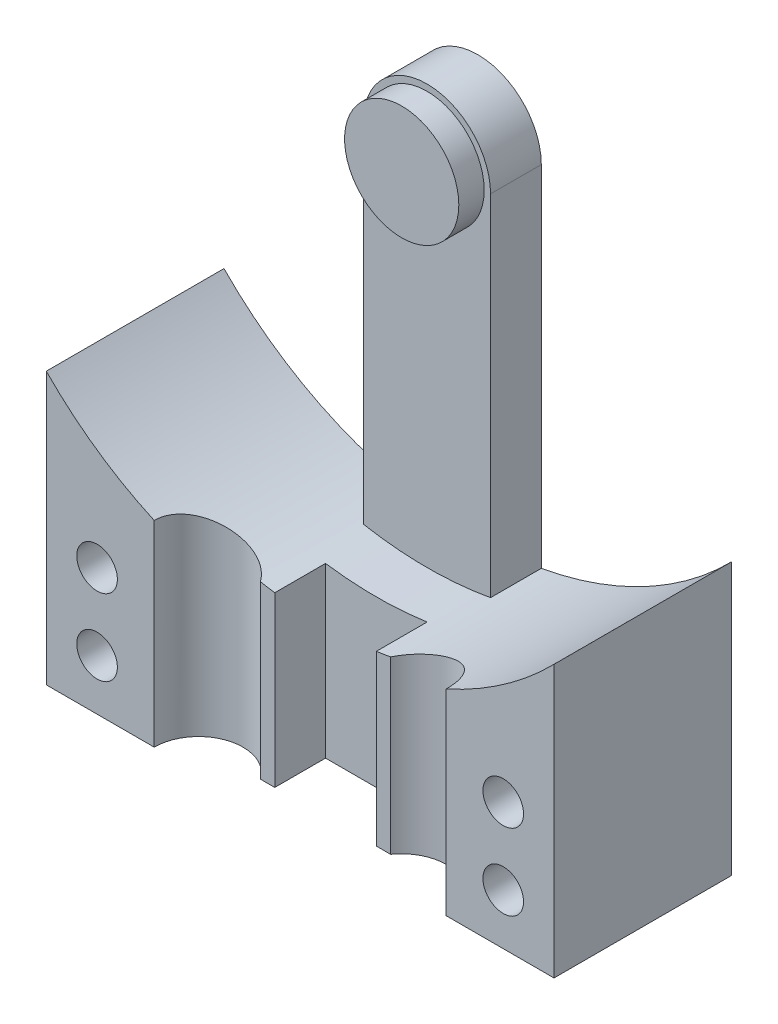
ISO-10303-21;
HEADER;
FILE_DESCRIPTION(('STEP AP214'),'2;1');
FILE_NAME('part.step','',(''),(''),'','','');
FILE_SCHEMA(('AUTOMOTIVE_DESIGN { 1 0 10303 214 1 1 1 1 }'));
ENDSEC;
DATA;
#1=APPLICATION_CONTEXT('core data for automotive mechanical design processes');
#2=APPLICATION_PROTOCOL_DEFINITION('international standard','automotive_design',2000,#1);
#3=PRODUCT_CONTEXT('',#1,'mechanical');
#4=PRODUCT('Part','Part','',(#3));
#5=PRODUCT_RELATED_PRODUCT_CATEGORY('part','',(#4));
#6=PRODUCT_DEFINITION_FORMATION('','',#4);
#7=PRODUCT_DEFINITION_CONTEXT('part definition',#1,'design');
#8=PRODUCT_DEFINITION('design','',#6,#7);
#9=PRODUCT_DEFINITION_SHAPE('','',#8);
#10=(LENGTH_UNIT() NAMED_UNIT(*) SI_UNIT(.MILLI.,.METRE.));
#11=(NAMED_UNIT(*) PLANE_ANGLE_UNIT() SI_UNIT($,.RADIAN.));
#12=(NAMED_UNIT(*) SI_UNIT($,.STERADIAN.) SOLID_ANGLE_UNIT());
#13=UNCERTAINTY_MEASURE_WITH_UNIT(LENGTH_MEASURE(1.E-05),#10,'distance_accuracy_value','');
#14=(GEOMETRIC_REPRESENTATION_CONTEXT(3) GLOBAL_UNCERTAINTY_ASSIGNED_CONTEXT((#13)) GLOBAL_UNIT_ASSIGNED_CONTEXT((#10,
#11,#12)) REPRESENTATION_CONTEXT('',''));
#15=CARTESIAN_POINT('',(0.,0.,0.));
#16=DIRECTION('',(0.,0.,1.));
#17=DIRECTION('',(1.,0.,0.));
#18=AXIS2_PLACEMENT_3D('',#15,#16,#17);
#19=CARTESIAN_POINT('',(0.,0.,7.));
#20=DIRECTION('',(0.,0.,-1.));
#21=DIRECTION('',(-1.,0.,0.));
#22=AXIS2_PLACEMENT_3D('',#19,#20,#21);
#23=CYLINDRICAL_SURFACE('',#22,14.);
#24=CARTESIAN_POINT('',(-5.75,-12.7646974112197,7.));
#25=CARTESIAN_POINT('',(-5.75000189053834,-12.7646949820717,6.9536056748903));
#26=CARTESIAN_POINT('',(-5.74815377005289,-12.7655292243542,6.90723516590935));
#27=CARTESIAN_POINT('',(-5.74079558024461,-12.7688406099331,6.81485759978246));
#28=CARTESIAN_POINT('',(-5.7352865458699,-12.7713172889088,6.7688504436344));
#29=CARTESIAN_POINT('',(-5.71338711484229,-12.7811375673264,6.63220455371071));
#30=CARTESIAN_POINT('',(-5.69162361873238,-12.7908719719431,6.54253357667148));
#31=CARTESIAN_POINT('',(-5.63467743792717,-12.8160588162994,6.36855813414669));
#32=CARTESIAN_POINT('',(-5.59950333289754,-12.8315075999794,6.28425027766922));
#33=CARTESIAN_POINT('',(-5.51701505107177,-12.8671892348959,6.12285513545865));
#34=CARTESIAN_POINT('',(-5.46969294902249,-12.8874252085769,6.04577260845731));
#35=CARTESIAN_POINT('',(-5.36214437777564,-12.9325535921242,5.8973578406083));
#36=CARTESIAN_POINT('',(-5.30145150011008,-12.957608488648,5.82641401516432));
#37=CARTESIAN_POINT('',(-5.17023092176259,-13.0105232743357,5.69552504735197));
#38=CARTESIAN_POINT('',(-5.09969993044948,-13.038384101151,5.63558360063578));
#39=CARTESIAN_POINT('',(-4.9446451138581,-13.0980114080074,5.52351767698197));
#40=CARTESIAN_POINT('',(-4.85945628332782,-13.1299125975737,5.47238335385173));
#41=CARTESIAN_POINT('',(-4.68184765418697,-13.1942876594728,5.38526367829712));
#42=CARTESIAN_POINT('',(-4.58942610297713,-13.2267616691227,5.34928201115647));
#43=CARTESIAN_POINT('',(-4.39554000433273,-13.2924841976696,5.29216778983188));
#44=CARTESIAN_POINT('',(-4.29385749778009,-13.3257059802071,5.27174024038447));
#45=CARTESIAN_POINT('',(-4.08790026378464,-13.390321734004,5.24914190993183));
#46=CARTESIAN_POINT('',(-3.98362553155516,-13.4217157018879,5.2469711626411));
#47=CARTESIAN_POINT('',(-3.77657635051463,-13.4814303576723,5.26125307452007));
#48=CARTESIAN_POINT('',(-3.67379727711227,-13.50977842985,5.27752130389903));
#49=CARTESIAN_POINT('',(-3.47193255052762,-13.5630593459072,5.32833337268214));
#50=CARTESIAN_POINT('',(-3.3728460244562,-13.5879930007036,5.36287286319037));
#51=CARTESIAN_POINT('',(-3.1854493492229,-13.6331159981332,5.44784754245569));
#52=CARTESIAN_POINT('',(-3.09686959802468,-13.6534524760392,5.49761005729263));
#53=CARTESIAN_POINT('',(-2.92915643393626,-13.6904135686977,5.61216040568269));
#54=CARTESIAN_POINT('',(-2.85002078486024,-13.707039062956,5.67694467163314));
#55=CARTESIAN_POINT('',(-2.70646206850301,-13.7360931174005,5.8172148815147));
#56=CARTESIAN_POINT('',(-2.64162172104466,-13.7486479663594,5.89224809907786));
#57=CARTESIAN_POINT('',(-2.5253497269985,-13.770480036917,6.05252704161274));
#58=CARTESIAN_POINT('',(-2.473920280943,-13.7797567207055,6.1377744392366));
#59=CARTESIAN_POINT('',(-2.38693010395009,-13.795089314298,6.31440699084264));
#60=CARTESIAN_POINT('',(-2.35110964192862,-13.8011982894606,6.40566006420865));
#61=CARTESIAN_POINT('',(-2.29520788542424,-13.8106059507261,6.59293395502945));
#62=CARTESIAN_POINT('',(-2.27510476736471,-13.8139085340679,6.68894796408377));
#63=CARTESIAN_POINT('',(-2.25876544163494,-13.8165838628274,6.82141601003498));
#64=CARTESIAN_POINT('',(-2.25547696824864,-13.8171208249112,6.85708451534379));
#65=CARTESIAN_POINT('',(-2.25109711371247,-13.8178351197109,6.92849680231269));
#66=CARTESIAN_POINT('',(-2.2500018764005,-13.8180130836237,6.96424034104868));
#67=CARTESIAN_POINT('',(-2.25,-13.8180136054355,7.));
#68=B_SPLINE_CURVE_WITH_KNOTS('',3,(#24,#25,#26,#27,#28,#29,#30,#31,#32,#33,#34,#35,#36,#37,#38,
#39,#40,#41,#42,#43,#44,#45,#46,#47,#48,#49,#50,#51,#52,#53,#54,#55,#56,#57,#58,#59,#60,#61,#62,
#63,#64,#65,#66,#67),.UNSPECIFIED.,.F.,.F.,(4,2,2,2,2,2,2,2,2,2,2,2,2,2,2,2,2,2,2,2,2,4),(0.,
0.139092219292273,0.278145133637704,0.555043965310998,0.831765942693738,1.10866891205412,
1.39744798784137,1.68632388649026,1.99799622017354,2.309744312097,2.63489692526134,
2.96005013887885,3.28197959635491,3.6038324631581,3.91312948221364,4.22235311963093,
4.5207781512994,4.81925211937181,5.11254988888105,5.40543968676446,5.51285828416295,
5.62008785106949),.UNSPECIFIED.);
#69=CARTESIAN_POINT('',(-5.75,-12.7646974112197,7.));
#70=VERTEX_POINT('',#69);
#71=CARTESIAN_POINT('',(-2.56385933836549,-13.7632345505363,6.));
#72=VERTEX_POINT('',#71);
#73=EDGE_CURVE('E218',#70,#72,#68,.T.);
#74=ORIENTED_EDGE('',*,*,#73,.T.);
#75=CARTESIAN_POINT('',(0.,0.,6.));
#76=DIRECTION('',(0.,0.,1.));
#77=DIRECTION('',(1.,0.,0.));
#78=AXIS2_PLACEMENT_3D('',#75,#76,#77);
#79=CIRCLE('',#78,14.);
#80=CARTESIAN_POINT('',(-2.,-13.856406460551,6.));
#81=VERTEX_POINT('',#80);
#82=EDGE_CURVE('E183',#72,#81,#79,.T.);
#83=ORIENTED_EDGE('',*,*,#82,.T.);
#84=DIRECTION('',(0.,0.,-1.));
#85=VECTOR('',#84,1.);
#86=CARTESIAN_POINT('',(-2.,-13.856406460551,7.));
#87=LINE('',#86,#85);
#88=CARTESIAN_POINT('',(-2.,-13.856406460551,4.));
#89=VERTEX_POINT('',#88);
#90=EDGE_CURVE('E157',#81,#89,#87,.T.);
#91=ORIENTED_EDGE('',*,*,#90,.T.);
#92=CARTESIAN_POINT('',(0.,0.,4.));
#93=DIRECTION('',(0.,0.,1.));
#94=DIRECTION('',(1.,0.,0.));
#95=AXIS2_PLACEMENT_3D('',#92,#93,#94);
#96=CIRCLE('',#95,14.);
#97=CARTESIAN_POINT('',(2.,-13.856406460551,4.));
#98=VERTEX_POINT('',#97);
#99=EDGE_CURVE('E185',#89,#98,#96,.T.);
#100=ORIENTED_EDGE('',*,*,#99,.T.);
#101=DIRECTION('',(0.,0.,-1.));
#102=VECTOR('',#101,1.);
#103=CARTESIAN_POINT('',(2.,-13.856406460551,7.));
#104=LINE('',#103,#102);
#105=CARTESIAN_POINT('',(2.,-13.856406460551,6.));
#106=VERTEX_POINT('',#105);
#107=EDGE_CURVE('E188',#98,#106,#104,.F.);
#108=ORIENTED_EDGE('',*,*,#107,.T.);
#109=CARTESIAN_POINT('',(0.,0.,6.));
#110=DIRECTION('',(0.,0.,1.));
#111=DIRECTION('',(1.,0.,0.));
#112=AXIS2_PLACEMENT_3D('',#109,#110,#111);
#113=CIRCLE('',#112,14.);
#114=CARTESIAN_POINT('',(2.56385933836549,-13.7632345505363,6.));
#115=VERTEX_POINT('',#114);
#116=EDGE_CURVE('E160',#106,#115,#113,.T.);
#117=ORIENTED_EDGE('',*,*,#116,.T.);
#118=CARTESIAN_POINT('',(4.,-13.4164078649987,5.25));
#119=CARTESIAN_POINT('',(4.10350168279073,-13.3855476695857,5.25000428651404));
#120=CARTESIAN_POINT('',(4.2067227616189,-13.3534566138628,5.25920879120629));
#121=CARTESIAN_POINT('',(4.40961479084573,-13.2878407889204,5.29548598351709));
#122=CARTESIAN_POINT('',(4.5092800919959,-13.2543139095619,5.32258587677814));
#123=CARTESIAN_POINT('',(4.70218684621989,-13.1871095933287,5.39376556168674));
#124=CARTESIAN_POINT('',(4.79543440367332,-13.1534323329003,5.43782894747883));
#125=CARTESIAN_POINT('',(4.97306914567581,-13.0873058122828,5.54184074011322));
#126=CARTESIAN_POINT('',(5.05745835053833,-13.0548562731734,5.60178551386893));
#127=CARTESIAN_POINT('',(5.21504718942886,-12.9927084875001,5.73631317655039));
#128=CARTESIAN_POINT('',(5.28823328796249,-12.9630135858593,5.81091352770343));
#129=CARTESIAN_POINT('',(5.42079965961544,-12.9081404920993,5.97297715760625));
#130=CARTESIAN_POINT('',(5.48018367350823,-12.8829610765735,6.06043694055322));
#131=CARTESIAN_POINT('',(5.57991468511833,-12.8400681373101,6.24078954258436));
#132=CARTESIAN_POINT('',(5.62112442686657,-12.8220219059157,6.33312456097229));
#133=CARTESIAN_POINT('',(5.68719135614027,-12.792856469617,6.52448903141355));
#134=CARTESIAN_POINT('',(5.71205974228838,-12.7817325211955,6.62351384756442));
#135=CARTESIAN_POINT('',(5.74287618976031,-12.7679141558519,6.81658668081193));
#136=CARTESIAN_POINT('',(5.75021831396984,-12.7645989484153,6.91036945532175));
#137=CARTESIAN_POINT('',(5.74977196526244,-12.7648002542795,7.09787970826666));
#138=CARTESIAN_POINT('',(5.74198743505961,-12.7683149873781,7.19160719474298));
#139=CARTESIAN_POINT('',(5.71227757032898,-12.7816324597895,7.37236719872148));
#140=CARTESIAN_POINT('',(5.69093965892574,-12.7911739012533,7.45951700579993));
#141=CARTESIAN_POINT('',(5.63553756745239,-12.8156789638197,7.6288529970594));
#142=CARTESIAN_POINT('',(5.60147188461279,-12.8306432251889,7.7110385937839));
#143=CARTESIAN_POINT('',(5.52047031807695,-12.8657067716975,7.87120214994966));
#144=CARTESIAN_POINT('',(5.47314067680288,-12.8859616127954,7.9489461529802));
#145=CARTESIAN_POINT('',(5.3676738531064,-12.9302491921815,8.09550311543989));
#146=CARTESIAN_POINT('',(5.30953321632972,-12.9542831375978,8.16431320831775));
#147=CARTESIAN_POINT('',(5.17915887551196,-13.0069834674489,8.29667417935614));
#148=CARTESIAN_POINT('',(5.10618396269485,-13.0358641895512,8.35940977762513));
#149=CARTESIAN_POINT('',(4.95145796710795,-13.0954166595084,8.47186373330557));
#150=CARTESIAN_POINT('',(4.86970379128208,-13.126089036841,8.52157748158354));
#151=CARTESIAN_POINT('',(4.69372799362968,-13.1900810195281,8.60983118401641));
#152=CARTESIAN_POINT('',(4.59903929129139,-13.2234414357176,8.64741336700592));
#153=CARTESIAN_POINT('',(4.40437776405604,-13.2895455956853,8.70566793441002));
#154=CARTESIAN_POINT('',(4.3044041660828,-13.3222892482876,8.72633783756342));
#155=CARTESIAN_POINT('',(4.10012043824881,-13.3865851014044,8.75020680270216));
#156=CARTESIAN_POINT('',(3.99576567229775,-13.4181080465271,8.75310654106982));
#157=CARTESIAN_POINT('',(3.78741255884286,-13.4783998424854,8.74017104920506));
#158=CARTESIAN_POINT('',(3.68341415918711,-13.5071691144901,8.72433868897674));
#159=CARTESIAN_POINT('',(3.48200801456737,-13.5604634672849,8.67470365515997));
#160=CARTESIAN_POINT('',(3.38449688952875,-13.5850862151212,8.64142654219612));
#161=CARTESIAN_POINT('',(3.19612845914592,-13.6306329564179,8.55785081415014));
#162=CARTESIAN_POINT('',(3.10526958145221,-13.6515578255862,8.50755623727979));
#163=CARTESIAN_POINT('',(2.93680510164311,-13.6887666876803,8.39357209126664));
#164=CARTESIAN_POINT('',(2.85881349430754,-13.7052034558243,8.33050244049394));
#165=CARTESIAN_POINT('',(2.71442380464817,-13.7345309820168,8.19156472638702));
#166=CARTESIAN_POINT('',(2.64802394211497,-13.7474222847375,8.1156986317995));
#167=CARTESIAN_POINT('',(2.53063840106815,-13.7695081075673,7.95554758628387));
#168=CARTESIAN_POINT('',(2.47928791677789,-13.7787922894433,7.87154211576135));
#169=CARTESIAN_POINT('',(2.39130974982023,-13.794333728174,7.69588923392478));
#170=CARTESIAN_POINT('',(2.35468106148032,-13.8005911917951,7.60424234512645));
#171=CARTESIAN_POINT('',(2.29762622665663,-13.8102044661532,7.41700917087699));
#172=CARTESIAN_POINT('',(2.27702509981617,-13.8135916505541,7.32147776685499));
#173=CARTESIAN_POINT('',(2.25199048147884,-13.8176952879699,7.1282634533353));
#174=CARTESIAN_POINT('',(2.24755665253957,-13.818411796727,7.03058058878552));
#175=CARTESIAN_POINT('',(2.25498171392298,-13.8172019700481,6.83614449602456));
#176=CARTESIAN_POINT('',(2.26679228812257,-13.8152834720007,6.73938936917804));
#177=CARTESIAN_POINT('',(2.30625818288144,-13.8087497129356,6.54926196404802));
#178=CARTESIAN_POINT('',(2.3339133592252,-13.8041344764632,6.45588965498276));
#179=CARTESIAN_POINT('',(2.40422445572187,-13.7920618201917,6.2751520769816));
#180=CARTESIAN_POINT('',(2.44688324656481,-13.7846038564614,6.18778796143985));
#181=CARTESIAN_POINT('',(2.54587721077315,-13.7666636830642,6.02153888773997));
#182=CARTESIAN_POINT('',(2.60221176704292,-13.7561816098511,5.94265354722321));
#183=CARTESIAN_POINT('',(2.72703288416464,-13.7319822323767,5.79525317746501));
#184=CARTESIAN_POINT('',(2.79556201945808,-13.7182535362046,5.72677609166025));
#185=CARTESIAN_POINT('',(2.94252715261543,-13.6874818607928,5.60231406202415));
#186=CARTESIAN_POINT('',(3.02096564763651,-13.6704380455574,5.54633227687974));
#187=CARTESIAN_POINT('',(3.18640217674972,-13.632832559336,5.44759528862041));
#188=CARTESIAN_POINT('',(3.27349705685734,-13.6122285886178,5.40501886060986));
#189=CARTESIAN_POINT('',(3.45273108954374,-13.5678717602734,5.33499566634189));
#190=CARTESIAN_POINT('',(3.54486541676023,-13.5441218849618,5.30753469620491));
#191=CARTESIAN_POINT('',(3.69791670532171,-13.5029351608654,5.27518692549052));
#192=CARTESIAN_POINT('',(3.75812803472161,-13.4863046122,5.26573210459441));
#193=CARTESIAN_POINT('',(3.87892485943255,-13.4520587956235,5.25313741832971));
#194=CARTESIAN_POINT('',(3.9395103512939,-13.4344435367791,5.24999749482596));
#195=CARTESIAN_POINT('',(4.,-13.4164078649987,5.25));
#196=B_SPLINE_CURVE_WITH_KNOTS('',3,(#118,#119,#120,#121,#122,#123,#124,#125,#126,#127,#128,
#129,#130,#131,#132,#133,#134,#135,#136,#137,#138,#139,#140,#141,#142,#143,#144,#145,#146,#147,
#148,#149,#150,#151,#152,#153,#154,#155,#156,#157,#158,#159,#160,#161,#162,#163,#164,#165,#166,
#167,#168,#169,#170,#171,#172,#173,#174,#175,#176,#177,#178,#179,#180,#181,#182,#183,#184,#185,
#186,#187,#188,#189,#190,#191,#192,#193,#194,#195),.UNSPECIFIED.,.T.,.F.,(4,2,2,2,2,2,2,2,2,2,2,
2,2,2,2,2,2,2,2,2,2,2,2,2,2,2,2,2,2,2,2,2,2,2,2,2,2,2,4),(0.,0.323778564799145,0.64805049389955,
0.972009595450396,1.29589465078389,1.62016798405182,1.94435332689327,2.25082894941158,
2.55709432657649,2.83804326063293,3.11891897607034,3.38838211103835,3.65787707161011,
3.93642139933994,4.21505488161231,4.51518432935328,4.81541986594336,5.13553435098462,
5.45569579275217,5.78123558741588,6.10672551155568,6.42292954165267,6.73905858969807,
7.04247632000506,7.34584741167497,7.64110359247917,7.93633960036964,8.22830529553565,
8.52026489678485,8.81135799083462,9.102448435435,9.39359460563655,9.68472764080387,
9.97689778512919,10.2691417037041,10.5651323803045,10.8608444398267,11.0500725897479,
11.2392989976206),.UNSPECIFIED.);
#197=CARTESIAN_POINT('',(5.75,-12.7646974112197,7.));
#198=VERTEX_POINT('',#197);
#199=EDGE_CURVE('E195',#115,#198,#196,.T.);
#200=ORIENTED_EDGE('',*,*,#199,.T.);
#201=CARTESIAN_POINT('',(0.,0.,7.));
#202=DIRECTION('',(0.,0.,1.));
#203=DIRECTION('',(1.,0.,0.));
#204=AXIS2_PLACEMENT_3D('',#201,#202,#203);
#205=CIRCLE('',#204,14.);
#206=CARTESIAN_POINT('',(10.,-9.79795897113271,7.));
#207=VERTEX_POINT('',#206);
#208=EDGE_CURVE('E291',#198,#207,#205,.T.);
#209=ORIENTED_EDGE('',*,*,#208,.T.);
#210=DIRECTION('',(0.,0.,-1.));
#211=VECTOR('',#210,1.);
#212=CARTESIAN_POINT('',(10.,-9.79795897113271,7.));
#213=LINE('',#212,#211);
#214=CARTESIAN_POINT('',(10.,-9.79795897113271,0.));
#215=VERTEX_POINT('',#214);
#216=EDGE_CURVE('E301',#207,#215,#213,.T.);
#217=ORIENTED_EDGE('',*,*,#216,.T.);
#218=CARTESIAN_POINT('',(0.,0.,0.));
#219=DIRECTION('',(0.,0.,1.));
#220=DIRECTION('',(1.,0.,0.));
#221=AXIS2_PLACEMENT_3D('',#218,#219,#220);
#222=CIRCLE('',#221,14.);
#223=CARTESIAN_POINT('',(2.5,-13.7749773139559,0.));
#224=VERTEX_POINT('',#223);
#225=EDGE_CURVE('E286',#224,#215,#222,.T.);
#226=ORIENTED_EDGE('',*,*,#225,.F.);
#227=DIRECTION('',(0.,0.,-1.));
#228=VECTOR('',#227,1.);
#229=CARTESIAN_POINT('',(2.5,-13.7749773139559,7.));
#230=LINE('',#229,#228);
#231=CARTESIAN_POINT('',(2.5,-13.7749773139559,2.));
#232=VERTEX_POINT('',#231);
#233=EDGE_CURVE('E278',#224,#232,#230,.F.);
#234=ORIENTED_EDGE('',*,*,#233,.T.);
#235=CARTESIAN_POINT('',(0.,0.,2.));
#236=DIRECTION('',(0.,0.,1.));
#237=DIRECTION('',(1.,0.,0.));
#238=AXIS2_PLACEMENT_3D('',#235,#236,#237);
#239=CIRCLE('',#238,14.);
#240=CARTESIAN_POINT('',(-2.5,-13.7749773139559,2.));
#241=VERTEX_POINT('',#240);
#242=EDGE_CURVE('E284',#241,#232,#239,.T.);
#243=ORIENTED_EDGE('',*,*,#242,.F.);
#244=DIRECTION('',(0.,0.,-1.));
#245=VECTOR('',#244,1.);
#246=CARTESIAN_POINT('',(-2.5,-13.7749773139559,7.));
#247=LINE('',#246,#245);
#248=CARTESIAN_POINT('',(-2.5,-13.7749773139559,0.));
#249=VERTEX_POINT('',#248);
#250=EDGE_CURVE('E281',#241,#249,#247,.T.);
#251=ORIENTED_EDGE('',*,*,#250,.T.);
#252=CARTESIAN_POINT('',(-10.,-9.79795897113271,0.));
#253=VERTEX_POINT('',#252);
#254=EDGE_CURVE('E302',#253,#249,#222,.T.);
#255=ORIENTED_EDGE('',*,*,#254,.F.);
#256=DIRECTION('',(0.,0.,-1.));
#257=VECTOR('',#256,1.);
#258=CARTESIAN_POINT('',(-10.,-9.79795897113271,7.));
#259=LINE('',#258,#257);
#260=CARTESIAN_POINT('',(-10.,-9.79795897113271,7.));
#261=VERTEX_POINT('',#260);
#262=EDGE_CURVE('E320',#261,#253,#259,.T.);
#263=ORIENTED_EDGE('',*,*,#262,.F.);
#264=EDGE_CURVE('E287',#261,#70,#205,.T.);
#265=ORIENTED_EDGE('',*,*,#264,.T.);
#266=EDGE_LOOP('',(#74,#83,#91,#100,#108,#117,#200,#209,#217,#226,#234,#243,#251,#255,#263,#265));
#267=FACE_BOUND('',#266,.T.);
#268=ADVANCED_FACE('F35',(#267),#23,.F.);
#269=CARTESIAN_POINT('',(0.,-20.5,7.));
#270=DIRECTION('',(0.,-1.,0.));
#271=DIRECTION('',(1.,0.,0.));
#272=AXIS2_PLACEMENT_3D('',#269,#270,#271);
#273=PLANE('',#272);
#274=DIRECTION('',(0.,0.,1.));
#275=VECTOR('',#274,1.);
#276=CARTESIAN_POINT('',(-2.,-20.5,6.));
#277=LINE('',#276,#275);
#278=CARTESIAN_POINT('',(-2.,-20.5,4.));
#279=VERTEX_POINT('',#278);
#280=CARTESIAN_POINT('',(-2.,-20.5,6.));
#281=VERTEX_POINT('',#280);
#282=EDGE_CURVE('E154',#279,#281,#277,.T.);
#283=ORIENTED_EDGE('',*,*,#282,.T.);
#284=DIRECTION('',(-1.,0.,0.));
#285=VECTOR('',#284,1.);
#286=CARTESIAN_POINT('',(-3.,-20.5,6.));
#287=LINE('',#286,#285);
#288=CARTESIAN_POINT('',(-2.56385933836549,-20.5,6.));
#289=VERTEX_POINT('',#288);
#290=EDGE_CURVE('E163',#281,#289,#287,.T.);
#291=ORIENTED_EDGE('',*,*,#290,.T.);
#292=CARTESIAN_POINT('',(-4.,-20.5,7.));
#293=DIRECTION('',(0.,1.,0.));
#294=DIRECTION('',(0.,0.,1.));
#295=AXIS2_PLACEMENT_3D('',#292,#293,#294);
#296=CIRCLE('',#295,1.75);
#297=CARTESIAN_POINT('',(-5.75,-20.5,7.));
#298=VERTEX_POINT('',#297);
#299=EDGE_CURVE('E58',#289,#298,#296,.T.);
#300=ORIENTED_EDGE('',*,*,#299,.T.);
#301=DIRECTION('',(-1.,0.,0.));
#302=VECTOR('',#301,1.);
#303=CARTESIAN_POINT('',(0.,-20.5,7.));
#304=LINE('',#303,#302);
#305=CARTESIAN_POINT('',(-10.,-20.5,7.));
#306=VERTEX_POINT('',#305);
#307=EDGE_CURVE('E294',#298,#306,#304,.T.);
#308=ORIENTED_EDGE('',*,*,#307,.T.);
#309=DIRECTION('',(0.,0.,-1.));
#310=VECTOR('',#309,1.);
#311=CARTESIAN_POINT('',(-10.,-20.5,7.));
#312=LINE('',#311,#310);
#313=CARTESIAN_POINT('',(-10.,-20.5,0.));
#314=VERTEX_POINT('',#313);
#315=EDGE_CURVE('E317',#306,#314,#312,.T.);
#316=ORIENTED_EDGE('',*,*,#315,.T.);
#317=DIRECTION('',(-1.,0.,0.));
#318=VECTOR('',#317,1.);
#319=CARTESIAN_POINT('',(0.,-20.5,0.));
#320=LINE('',#319,#318);
#321=CARTESIAN_POINT('',(10.,-20.5,0.));
#322=VERTEX_POINT('',#321);
#323=EDGE_CURVE('E308',#322,#314,#320,.T.);
#324=ORIENTED_EDGE('',*,*,#323,.F.);
#325=DIRECTION('',(0.,0.,-1.));
#326=VECTOR('',#325,1.);
#327=CARTESIAN_POINT('',(10.,-20.5,7.));
#328=LINE('',#327,#326);
#329=CARTESIAN_POINT('',(10.,-20.5,7.));
#330=VERTEX_POINT('',#329);
#331=EDGE_CURVE('E315',#330,#322,#328,.T.);
#332=ORIENTED_EDGE('',*,*,#331,.F.);
#333=CARTESIAN_POINT('',(5.75,-20.5,7.));
#334=VERTEX_POINT('',#333);
#335=EDGE_CURVE('E295',#330,#334,#304,.T.);
#336=ORIENTED_EDGE('',*,*,#335,.T.);
#337=CARTESIAN_POINT('',(4.,-20.5,7.));
#338=DIRECTION('',(0.,1.,0.));
#339=DIRECTION('',(0.,0.,1.));
#340=AXIS2_PLACEMENT_3D('',#337,#338,#339);
#341=CIRCLE('',#340,1.75);
#342=CARTESIAN_POINT('',(2.56385933836549,-20.5,6.));
#343=VERTEX_POINT('',#342);
#344=EDGE_CURVE('E192',#334,#343,#341,.T.);
#345=ORIENTED_EDGE('',*,*,#344,.T.);
#346=DIRECTION('',(-1.,0.,0.));
#347=VECTOR('',#346,1.);
#348=CARTESIAN_POINT('',(2.,-20.5,6.));
#349=LINE('',#348,#347);
#350=CARTESIAN_POINT('',(2.,-20.5,6.));
#351=VERTEX_POINT('',#350);
#352=EDGE_CURVE('E50',#343,#351,#349,.T.);
#353=ORIENTED_EDGE('',*,*,#352,.T.);
#354=DIRECTION('',(0.,0.,-1.));
#355=VECTOR('',#354,1.);
#356=CARTESIAN_POINT('',(2.,-20.5,4.));
#357=LINE('',#356,#355);
#358=CARTESIAN_POINT('',(2.,-20.5,4.));
#359=VERTEX_POINT('',#358);
#360=EDGE_CURVE('E173',#351,#359,#357,.T.);
#361=ORIENTED_EDGE('',*,*,#360,.T.);
#362=DIRECTION('',(-1.,0.,0.));
#363=VECTOR('',#362,1.);
#364=CARTESIAN_POINT('',(-2.,-20.5,4.));
#365=LINE('',#364,#363);
#366=EDGE_CURVE('E169',#359,#279,#365,.T.);
#367=ORIENTED_EDGE('',*,*,#366,.T.);
#368=EDGE_LOOP('',(#283,#291,#300,#308,#316,#324,#332,#336,#345,#353,#361,#367));
#369=FACE_BOUND('',#368,.T.);
#370=ADVANCED_FACE('F166',(#369),#273,.T.);
#371=CARTESIAN_POINT('',(-4.,-2.,7.));
#372=DIRECTION('',(0.,-1.,0.));
#373=DIRECTION('',(0.,0.,-1.));
#374=AXIS2_PLACEMENT_3D('',#371,#372,#373);
#375=CYLINDRICAL_SURFACE('',#374,1.75);
#376=ORIENTED_EDGE('',*,*,#299,.F.);
#377=DIRECTION('',(0.,-1.,0.));
#378=VECTOR('',#377,1.);
#379=CARTESIAN_POINT('',(-2.56385933836549,-2.,6.));
#380=LINE('',#379,#378);
#381=EDGE_CURVE('E11',#289,#72,#380,.F.);
#382=ORIENTED_EDGE('',*,*,#381,.T.);
#383=ORIENTED_EDGE('',*,*,#73,.F.);
#384=DIRECTION('',(0.,-1.,0.));
#385=VECTOR('',#384,1.);
#386=CARTESIAN_POINT('',(-5.75,-2.,7.));
#387=LINE('',#386,#385);
#388=EDGE_CURVE('E224',#298,#70,#387,.F.);
#389=ORIENTED_EDGE('',*,*,#388,.F.);
#390=EDGE_LOOP('',(#376,#382,#383,#389));
#391=FACE_BOUND('',#390,.T.);
#392=ADVANCED_FACE('F208',(#391),#375,.F.);
#393=CARTESIAN_POINT('',(4.,-2.,7.));
#394=DIRECTION('',(0.,-1.,0.));
#395=DIRECTION('',(0.,0.,-1.));
#396=AXIS2_PLACEMENT_3D('',#393,#394,#395);
#397=CYLINDRICAL_SURFACE('',#396,1.75);
#398=ORIENTED_EDGE('',*,*,#199,.F.);
#399=DIRECTION('',(0.,-1.,0.));
#400=VECTOR('',#399,1.);
#401=CARTESIAN_POINT('',(2.56385933836549,-2.,6.));
#402=LINE('',#401,#400);
#403=EDGE_CURVE('E43',#115,#343,#402,.T.);
#404=ORIENTED_EDGE('',*,*,#403,.T.);
#405=ORIENTED_EDGE('',*,*,#344,.F.);
#406=DIRECTION('',(0.,-1.,0.));
#407=VECTOR('',#406,1.);
#408=CARTESIAN_POINT('',(5.75,-2.,7.));
#409=LINE('',#408,#407);
#410=EDGE_CURVE('E200',#198,#334,#409,.T.);
#411=ORIENTED_EDGE('',*,*,#410,.F.);
#412=EDGE_LOOP('',(#398,#404,#405,#411));
#413=FACE_BOUND('',#412,.T.);
#414=ADVANCED_FACE('F202',(#413),#397,.F.);
#415=CARTESIAN_POINT('',(0.,0.,7.));
#416=DIRECTION('',(0.,0.,1.));
#417=DIRECTION('',(1.,0.,0.));
#418=AXIS2_PLACEMENT_3D('',#415,#416,#417);
#419=PLANE('',#418);
#420=CARTESIAN_POINT('',(8.,-15.5,7.));
#421=DIRECTION('',(0.,0.,1.));
#422=DIRECTION('',(1.,0.,0.));
#423=AXIS2_PLACEMENT_3D('',#420,#421,#422);
#424=CIRCLE('',#423,0.800000000000001);
#425=CARTESIAN_POINT('',(8.8,-15.5,7.));
#426=VERTEX_POINT('',#425);
#427=EDGE_CURVE('E234',#426,#426,#424,.T.);
#428=ORIENTED_EDGE('',*,*,#427,.F.);
#429=EDGE_LOOP('',(#428));
#430=FACE_BOUND('',#429,.T.);
#431=CARTESIAN_POINT('',(8.,-18.5,7.));
#432=DIRECTION('',(0.,0.,1.));
#433=DIRECTION('',(1.,0.,0.));
#434=AXIS2_PLACEMENT_3D('',#431,#432,#433);
#435=CIRCLE('',#434,0.8);
#436=CARTESIAN_POINT('',(8.8,-18.5,7.));
#437=VERTEX_POINT('',#436);
#438=EDGE_CURVE('E228',#437,#437,#435,.T.);
#439=ORIENTED_EDGE('',*,*,#438,.F.);
#440=EDGE_LOOP('',(#439));
#441=FACE_BOUND('',#440,.T.);
#442=ORIENTED_EDGE('',*,*,#208,.F.);
#443=ORIENTED_EDGE('',*,*,#410,.T.);
#444=ORIENTED_EDGE('',*,*,#335,.F.);
#445=DIRECTION('',(0.,-1.,0.));
#446=VECTOR('',#445,1.);
#447=CARTESIAN_POINT('',(10.,0.,7.));
#448=LINE('',#447,#446);
#449=EDGE_CURVE('E298',#207,#330,#448,.T.);
#450=ORIENTED_EDGE('',*,*,#449,.F.);
#451=EDGE_LOOP('',(#442,#443,#444,#450));
#452=FACE_BOUND('',#451,.T.);
#453=ADVANCED_FACE('F207',(#430,#441,#452),#419,.T.);
#454=CARTESIAN_POINT('',(-8.,-15.5,7.));
#455=DIRECTION('',(0.,0.,1.));
#456=DIRECTION('',(1.,0.,0.));
#457=AXIS2_PLACEMENT_3D('',#454,#455,#456);
#458=CIRCLE('',#457,0.800000000000001);
#459=CARTESIAN_POINT('',(-7.2,-15.5,7.));
#460=VERTEX_POINT('',#459);
#461=EDGE_CURVE('E240',#460,#460,#458,.T.);
#462=ORIENTED_EDGE('',*,*,#461,.F.);
#463=EDGE_LOOP('',(#462));
#464=FACE_BOUND('',#463,.T.);
#465=CARTESIAN_POINT('',(-8.,-18.5,7.));
#466=DIRECTION('',(0.,0.,1.));
#467=DIRECTION('',(1.,0.,0.));
#468=AXIS2_PLACEMENT_3D('',#465,#466,#467);
#469=CIRCLE('',#468,0.799999999999999);
#470=CARTESIAN_POINT('',(-7.2,-18.5,7.));
#471=VERTEX_POINT('',#470);
#472=EDGE_CURVE('E246',#471,#471,#469,.T.);
#473=ORIENTED_EDGE('',*,*,#472,.F.);
#474=EDGE_LOOP('',(#473));
#475=FACE_BOUND('',#474,.T.);
#476=ORIENTED_EDGE('',*,*,#307,.F.);
#477=ORIENTED_EDGE('',*,*,#388,.T.);
#478=ORIENTED_EDGE('',*,*,#264,.F.);
#479=DIRECTION('',(0.,1.,0.));
#480=VECTOR('',#479,1.);
#481=CARTESIAN_POINT('',(-10.,0.,7.));
#482=LINE('',#481,#480);
#483=EDGE_CURVE('E290',#306,#261,#482,.T.);
#484=ORIENTED_EDGE('',*,*,#483,.F.);
#485=EDGE_LOOP('',(#476,#477,#478,#484));
#486=FACE_BOUND('',#485,.T.);
#487=ADVANCED_FACE('F347',(#464,#475,#486),#419,.T.);
#488=CARTESIAN_POINT('',(0.,0.,0.));
#489=DIRECTION('',(0.,0.,1.));
#490=DIRECTION('',(1.,0.,0.));
#491=AXIS2_PLACEMENT_3D('',#488,#489,#490);
#492=PLANE('',#491);
#493=CARTESIAN_POINT('',(8.,-15.5,0.));
#494=DIRECTION('',(0.,0.,1.));
#495=DIRECTION('',(1.,0.,0.));
#496=AXIS2_PLACEMENT_3D('',#493,#494,#495);
#497=CIRCLE('',#496,0.800000000000001);
#498=CARTESIAN_POINT('',(8.8,-15.5,0.));
#499=VERTEX_POINT('',#498);
#500=EDGE_CURVE('E231',#499,#499,#497,.T.);
#501=ORIENTED_EDGE('',*,*,#500,.T.);
#502=EDGE_LOOP('',(#501));
#503=FACE_BOUND('',#502,.T.);
#504=CARTESIAN_POINT('',(-8.,-18.5,0.));
#505=DIRECTION('',(0.,0.,1.));
#506=DIRECTION('',(1.,0.,0.));
#507=AXIS2_PLACEMENT_3D('',#504,#505,#506);
#508=CIRCLE('',#507,0.799999999999999);
#509=CARTESIAN_POINT('',(-7.2,-18.5,0.));
#510=VERTEX_POINT('',#509);
#511=EDGE_CURVE('E243',#510,#510,#508,.T.);
#512=ORIENTED_EDGE('',*,*,#511,.T.);
#513=EDGE_LOOP('',(#512));
#514=FACE_BOUND('',#513,.T.);
#515=ORIENTED_EDGE('',*,*,#323,.T.);
#516=DIRECTION('',(0.,1.,0.));
#517=VECTOR('',#516,1.);
#518=CARTESIAN_POINT('',(-10.,0.,0.));
#519=LINE('',#518,#517);
#520=EDGE_CURVE('E305',#314,#253,#519,.T.);
#521=ORIENTED_EDGE('',*,*,#520,.T.);
#522=ORIENTED_EDGE('',*,*,#254,.T.);
#523=DIRECTION('',(0.,-1.,0.));
#524=VECTOR('',#523,1.);
#525=CARTESIAN_POINT('',(-2.5,0.,0.));
#526=LINE('',#525,#524);
#527=CARTESIAN_POINT('',(-2.5,0.,0.));
#528=VERTEX_POINT('',#527);
#529=EDGE_CURVE('E270',#528,#249,#526,.T.);
#530=ORIENTED_EDGE('',*,*,#529,.F.);
#531=CARTESIAN_POINT('',(0.,0.,0.));
#532=DIRECTION('',(0.,0.,1.));
#533=DIRECTION('',(1.,0.,0.));
#534=AXIS2_PLACEMENT_3D('',#531,#532,#533);
#535=CIRCLE('',#534,2.5);
#536=CARTESIAN_POINT('',(2.5,0.,0.));
#537=VERTEX_POINT('',#536);
#538=EDGE_CURVE('E255',#537,#528,#535,.T.);
#539=ORIENTED_EDGE('',*,*,#538,.F.);
#540=DIRECTION('',(0.,1.,0.));
#541=VECTOR('',#540,1.);
#542=CARTESIAN_POINT('',(2.5,-20.5,0.));
#543=LINE('',#542,#541);
#544=EDGE_CURVE('E262',#224,#537,#543,.T.);
#545=ORIENTED_EDGE('',*,*,#544,.F.);
#546=ORIENTED_EDGE('',*,*,#225,.T.);
#547=DIRECTION('',(0.,-1.,0.));
#548=VECTOR('',#547,1.);
#549=CARTESIAN_POINT('',(10.,0.,0.));
#550=LINE('',#549,#548);
#551=EDGE_CURVE('E310',#215,#322,#550,.T.);
#552=ORIENTED_EDGE('',*,*,#551,.T.);
#553=EDGE_LOOP('',(#515,#521,#522,#530,#539,#545,#546,#552));
#554=FACE_BOUND('',#553,.T.);
#555=CARTESIAN_POINT('',(-8.,-15.5,0.));
#556=DIRECTION('',(0.,0.,1.));
#557=DIRECTION('',(1.,0.,0.));
#558=AXIS2_PLACEMENT_3D('',#555,#556,#557);
#559=CIRCLE('',#558,0.800000000000001);
#560=CARTESIAN_POINT('',(-7.2,-15.5,0.));
#561=VERTEX_POINT('',#560);
#562=EDGE_CURVE('E237',#561,#561,#559,.T.);
#563=ORIENTED_EDGE('',*,*,#562,.T.);
#564=EDGE_LOOP('',(#563));
#565=FACE_BOUND('',#564,.T.);
#566=CARTESIAN_POINT('',(8.,-18.5,0.));
#567=DIRECTION('',(0.,0.,1.));
#568=DIRECTION('',(1.,0.,0.));
#569=AXIS2_PLACEMENT_3D('',#566,#567,#568);
#570=CIRCLE('',#569,0.8);
#571=CARTESIAN_POINT('',(8.8,-18.5,0.));
#572=VERTEX_POINT('',#571);
#573=EDGE_CURVE('E227',#572,#572,#570,.T.);
#574=ORIENTED_EDGE('',*,*,#573,.T.);
#575=EDGE_LOOP('',(#574));
#576=FACE_BOUND('',#575,.T.);
#577=ADVANCED_FACE('F354',(#503,#514,#554,#565,#576),#492,.F.);
#578=CARTESIAN_POINT('',(0.,0.,2.));
#579=DIRECTION('',(0.,0.,1.));
#580=DIRECTION('',(1.,0.,0.));
#581=AXIS2_PLACEMENT_3D('',#578,#579,#580);
#582=PLANE('',#581);
#583=DIRECTION('',(0.,-1.,0.));
#584=VECTOR('',#583,1.);
#585=CARTESIAN_POINT('',(-2.5,0.,2.));
#586=LINE('',#585,#584);
#587=CARTESIAN_POINT('',(-2.5,0.,2.));
#588=VERTEX_POINT('',#587);
#589=EDGE_CURVE('E261',#588,#241,#586,.T.);
#590=ORIENTED_EDGE('',*,*,#589,.T.);
#591=ORIENTED_EDGE('',*,*,#242,.T.);
#592=DIRECTION('',(0.,1.,0.));
#593=VECTOR('',#592,1.);
#594=CARTESIAN_POINT('',(2.5,-20.5,2.));
#595=LINE('',#594,#593);
#596=CARTESIAN_POINT('',(2.5,0.,2.));
#597=VERTEX_POINT('',#596);
#598=EDGE_CURVE('E265',#232,#597,#595,.T.);
#599=ORIENTED_EDGE('',*,*,#598,.T.);
#600=CARTESIAN_POINT('',(0.,0.,2.));
#601=DIRECTION('',(0.,0.,1.));
#602=DIRECTION('',(1.,0.,0.));
#603=AXIS2_PLACEMENT_3D('',#600,#601,#602);
#604=CIRCLE('',#603,2.5);
#605=EDGE_CURVE('E258',#597,#588,#604,.T.);
#606=ORIENTED_EDGE('',*,*,#605,.T.);
#607=EDGE_LOOP('',(#590,#591,#599,#606));
#608=FACE_BOUND('',#607,.T.);
#609=CARTESIAN_POINT('',(0.,0.,2.));
#610=DIRECTION('',(0.,0.,1.));
#611=DIRECTION('',(1.,0.,0.));
#612=AXIS2_PLACEMENT_3D('',#609,#610,#611);
#613=CIRCLE('',#612,2.25);
#614=CARTESIAN_POINT('',(2.25,0.,2.));
#615=VERTEX_POINT('',#614);
#616=EDGE_CURVE('E249',#615,#615,#613,.T.);
#617=ORIENTED_EDGE('',*,*,#616,.F.);
#618=EDGE_LOOP('',(#617));
#619=FACE_BOUND('',#618,.T.);
#620=ADVANCED_FACE('F364',(#608,#619),#582,.T.);
#621=CARTESIAN_POINT('',(-10.,0.,7.));
#622=DIRECTION('',(-1.,0.,0.));
#623=DIRECTION('',(0.,0.,1.));
#624=AXIS2_PLACEMENT_3D('',#621,#622,#623);
#625=PLANE('',#624);
#626=ORIENTED_EDGE('',*,*,#520,.F.);
#627=ORIENTED_EDGE('',*,*,#315,.F.);
#628=ORIENTED_EDGE('',*,*,#483,.T.);
#629=ORIENTED_EDGE('',*,*,#262,.T.);
#630=EDGE_LOOP('',(#626,#627,#628,#629));
#631=FACE_BOUND('',#630,.T.);
#632=ADVANCED_FACE('F351',(#631),#625,.T.);
#633=CARTESIAN_POINT('',(10.,0.,7.));
#634=DIRECTION('',(1.,0.,0.));
#635=DIRECTION('',(0.,1.,0.));
#636=AXIS2_PLACEMENT_3D('',#633,#634,#635);
#637=PLANE('',#636);
#638=ORIENTED_EDGE('',*,*,#551,.F.);
#639=ORIENTED_EDGE('',*,*,#216,.F.);
#640=ORIENTED_EDGE('',*,*,#449,.T.);
#641=ORIENTED_EDGE('',*,*,#331,.T.);
#642=EDGE_LOOP('',(#638,#639,#640,#641));
#643=FACE_BOUND('',#642,.T.);
#644=ADVANCED_FACE('F332',(#643),#637,.T.);
#645=CARTESIAN_POINT('',(0.,0.,2.));
#646=DIRECTION('',(0.,0.,-1.));
#647=DIRECTION('',(-1.,0.,0.));
#648=AXIS2_PLACEMENT_3D('',#645,#646,#647);
#649=CYLINDRICAL_SURFACE('',#648,2.5);
#650=ORIENTED_EDGE('',*,*,#538,.T.);
#651=DIRECTION('',(0.,0.,-1.));
#652=VECTOR('',#651,1.);
#653=CARTESIAN_POINT('',(-2.5,0.,2.));
#654=LINE('',#653,#652);
#655=EDGE_CURVE('E275',#588,#528,#654,.T.);
#656=ORIENTED_EDGE('',*,*,#655,.F.);
#657=ORIENTED_EDGE('',*,*,#605,.F.);
#658=DIRECTION('',(0.,0.,-1.));
#659=VECTOR('',#658,1.);
#660=CARTESIAN_POINT('',(2.5,0.,2.));
#661=LINE('',#660,#659);
#662=EDGE_CURVE('E267',#597,#537,#661,.T.);
#663=ORIENTED_EDGE('',*,*,#662,.T.);
#664=EDGE_LOOP('',(#650,#656,#657,#663));
#665=FACE_BOUND('',#664,.T.);
#666=ADVANCED_FACE('F371',(#665),#649,.T.);
#667=CARTESIAN_POINT('',(-2.5,0.,2.));
#668=DIRECTION('',(1.,0.,0.));
#669=DIRECTION('',(0.,1.,0.));
#670=AXIS2_PLACEMENT_3D('',#667,#668,#669);
#671=PLANE('',#670);
#672=ORIENTED_EDGE('',*,*,#250,.F.);
#673=ORIENTED_EDGE('',*,*,#589,.F.);
#674=ORIENTED_EDGE('',*,*,#655,.T.);
#675=ORIENTED_EDGE('',*,*,#529,.T.);
#676=EDGE_LOOP('',(#672,#673,#674,#675));
#677=FACE_BOUND('',#676,.T.);
#678=ADVANCED_FACE('F369',(#677),#671,.F.);
#679=CARTESIAN_POINT('',(2.5,-20.5,2.));
#680=DIRECTION('',(-1.,0.,0.));
#681=DIRECTION('',(0.,-1.,0.));
#682=AXIS2_PLACEMENT_3D('',#679,#680,#681);
#683=PLANE('',#682);
#684=ORIENTED_EDGE('',*,*,#233,.F.);
#685=ORIENTED_EDGE('',*,*,#544,.T.);
#686=ORIENTED_EDGE('',*,*,#662,.F.);
#687=ORIENTED_EDGE('',*,*,#598,.F.);
#688=EDGE_LOOP('',(#684,#685,#686,#687));
#689=FACE_BOUND('',#688,.T.);
#690=ADVANCED_FACE('F361',(#689),#683,.F.);
#691=CARTESIAN_POINT('',(0.,0.,3.));
#692=DIRECTION('',(0.,0.,-1.));
#693=DIRECTION('',(-1.,0.,0.));
#694=AXIS2_PLACEMENT_3D('',#691,#692,#693);
#695=CYLINDRICAL_SURFACE('',#694,2.25);
#696=CARTESIAN_POINT('',(0.,0.,3.));
#697=DIRECTION('',(0.,0.,1.));
#698=DIRECTION('',(1.,0.,0.));
#699=AXIS2_PLACEMENT_3D('',#696,#697,#698);
#700=CIRCLE('',#699,2.25);
#701=CARTESIAN_POINT('',(2.25,0.,3.));
#702=VERTEX_POINT('',#701);
#703=EDGE_CURVE('E252',#702,#702,#700,.T.);
#704=ORIENTED_EDGE('',*,*,#703,.F.);
#705=EDGE_LOOP('',(#704));
#706=FACE_BOUND('',#705,.T.);
#707=ORIENTED_EDGE('',*,*,#616,.T.);
#708=EDGE_LOOP('',(#707));
#709=FACE_BOUND('',#708,.T.);
#710=ADVANCED_FACE('F400',(#706,#709),#695,.T.);
#711=CARTESIAN_POINT('',(0.,0.,3.));
#712=DIRECTION('',(0.,0.,1.));
#713=DIRECTION('',(1.,0.,0.));
#714=AXIS2_PLACEMENT_3D('',#711,#712,#713);
#715=PLANE('',#714);
#716=ORIENTED_EDGE('',*,*,#703,.T.);
#717=EDGE_LOOP('',(#716));
#718=FACE_BOUND('',#717,.T.);
#719=ADVANCED_FACE('F406',(#718),#715,.T.);
#720=CARTESIAN_POINT('',(-8.,-18.5,7.));
#721=DIRECTION('',(0.,0.,-1.));
#722=DIRECTION('',(-1.,0.,0.));
#723=AXIS2_PLACEMENT_3D('',#720,#721,#722);
#724=CYLINDRICAL_SURFACE('',#723,0.799999999999999);
#725=ORIENTED_EDGE('',*,*,#472,.T.);
#726=EDGE_LOOP('',(#725));
#727=FACE_BOUND('',#726,.T.);
#728=ORIENTED_EDGE('',*,*,#511,.F.);
#729=EDGE_LOOP('',(#728));
#730=FACE_BOUND('',#729,.T.);
#731=ADVANCED_FACE('F411',(#727,#730),#724,.F.);
#732=CARTESIAN_POINT('',(-8.,-15.5,7.));
#733=DIRECTION('',(0.,0.,-1.));
#734=DIRECTION('',(-1.,0.,0.));
#735=AXIS2_PLACEMENT_3D('',#732,#733,#734);
#736=CYLINDRICAL_SURFACE('',#735,0.800000000000001);
#737=ORIENTED_EDGE('',*,*,#461,.T.);
#738=EDGE_LOOP('',(#737));
#739=FACE_BOUND('',#738,.T.);
#740=ORIENTED_EDGE('',*,*,#562,.F.);
#741=EDGE_LOOP('',(#740));
#742=FACE_BOUND('',#741,.T.);
#743=ADVANCED_FACE('F419',(#739,#742),#736,.F.);
#744=CARTESIAN_POINT('',(8.,-15.5,7.));
#745=DIRECTION('',(0.,0.,-1.));
#746=DIRECTION('',(-1.,0.,0.));
#747=AXIS2_PLACEMENT_3D('',#744,#745,#746);
#748=CYLINDRICAL_SURFACE('',#747,0.800000000000001);
#749=ORIENTED_EDGE('',*,*,#427,.T.);
#750=EDGE_LOOP('',(#749));
#751=FACE_BOUND('',#750,.T.);
#752=ORIENTED_EDGE('',*,*,#500,.F.);
#753=EDGE_LOOP('',(#752));
#754=FACE_BOUND('',#753,.T.);
#755=ADVANCED_FACE('F424',(#751,#754),#748,.F.);
#756=CARTESIAN_POINT('',(8.,-18.5,7.));
#757=DIRECTION('',(0.,0.,-1.));
#758=DIRECTION('',(-1.,0.,0.));
#759=AXIS2_PLACEMENT_3D('',#756,#757,#758);
#760=CYLINDRICAL_SURFACE('',#759,0.8);
#761=ORIENTED_EDGE('',*,*,#438,.T.);
#762=EDGE_LOOP('',(#761));
#763=FACE_BOUND('',#762,.T.);
#764=ORIENTED_EDGE('',*,*,#573,.F.);
#765=EDGE_LOOP('',(#764));
#766=FACE_BOUND('',#765,.T.);
#767=ADVANCED_FACE('F215',(#763,#766),#760,.F.);
#768=CARTESIAN_POINT('',(-2.,-13.,6.));
#769=DIRECTION('',(1.,0.,0.));
#770=DIRECTION('',(0.,0.,-1.));
#771=AXIS2_PLACEMENT_3D('',#768,#769,#770);
#772=PLANE('',#771);
#773=DIRECTION('',(0.,-1.,0.));
#774=VECTOR('',#773,1.);
#775=CARTESIAN_POINT('',(-2.,-13.,6.));
#776=LINE('',#775,#774);
#777=EDGE_CURVE('E149',#81,#281,#776,.T.);
#778=ORIENTED_EDGE('',*,*,#777,.T.);
#779=ORIENTED_EDGE('',*,*,#282,.F.);
#780=DIRECTION('',(0.,-1.,0.));
#781=VECTOR('',#780,1.);
#782=CARTESIAN_POINT('',(-2.,-13.,4.));
#783=LINE('',#782,#781);
#784=EDGE_CURVE('E176',#89,#279,#783,.T.);
#785=ORIENTED_EDGE('',*,*,#784,.F.);
#786=ORIENTED_EDGE('',*,*,#90,.F.);
#787=EDGE_LOOP('',(#778,#779,#785,#786));
#788=FACE_BOUND('',#787,.T.);
#789=ADVANCED_FACE('F151',(#788),#772,.T.);
#790=CARTESIAN_POINT('',(-3.,-13.,6.));
#791=DIRECTION('',(0.,0.,1.));
#792=DIRECTION('',(1.,0.,0.));
#793=AXIS2_PLACEMENT_3D('',#790,#791,#792);
#794=PLANE('',#793);
#795=ORIENTED_EDGE('',*,*,#381,.F.);
#796=ORIENTED_EDGE('',*,*,#290,.F.);
#797=ORIENTED_EDGE('',*,*,#777,.F.);
#798=ORIENTED_EDGE('',*,*,#82,.F.);
#799=EDGE_LOOP('',(#795,#796,#797,#798));
#800=FACE_BOUND('',#799,.T.);
#801=ADVANCED_FACE('F164',(#800),#794,.T.);
#802=CARTESIAN_POINT('',(2.,-13.,6.));
#803=DIRECTION('',(0.,0.,1.));
#804=DIRECTION('',(1.,0.,0.));
#805=AXIS2_PLACEMENT_3D('',#802,#803,#804);
#806=PLANE('',#805);
#807=DIRECTION('',(0.,-1.,0.));
#808=VECTOR('',#807,1.);
#809=CARTESIAN_POINT('',(2.,-13.,6.));
#810=LINE('',#809,#808);
#811=EDGE_CURVE('E161',#106,#351,#810,.T.);
#812=ORIENTED_EDGE('',*,*,#811,.T.);
#813=ORIENTED_EDGE('',*,*,#352,.F.);
#814=ORIENTED_EDGE('',*,*,#403,.F.);
#815=ORIENTED_EDGE('',*,*,#116,.F.);
#816=EDGE_LOOP('',(#812,#813,#814,#815));
#817=FACE_BOUND('',#816,.T.);
#818=ADVANCED_FACE('F336',(#817),#806,.T.);
#819=CARTESIAN_POINT('',(2.,-13.,4.));
#820=DIRECTION('',(-1.,0.,0.));
#821=DIRECTION('',(0.,0.,1.));
#822=AXIS2_PLACEMENT_3D('',#819,#820,#821);
#823=PLANE('',#822);
#824=DIRECTION('',(0.,-1.,0.));
#825=VECTOR('',#824,1.);
#826=CARTESIAN_POINT('',(2.,-13.,4.));
#827=LINE('',#826,#825);
#828=EDGE_CURVE('E178',#98,#359,#827,.T.);
#829=ORIENTED_EDGE('',*,*,#828,.T.);
#830=ORIENTED_EDGE('',*,*,#360,.F.);
#831=ORIENTED_EDGE('',*,*,#811,.F.);
#832=ORIENTED_EDGE('',*,*,#107,.F.);
#833=EDGE_LOOP('',(#829,#830,#831,#832));
#834=FACE_BOUND('',#833,.T.);
#835=ADVANCED_FACE('F339',(#834),#823,.T.);
#836=CARTESIAN_POINT('',(-2.,-13.,4.));
#837=DIRECTION('',(0.,0.,1.));
#838=DIRECTION('',(1.,0.,0.));
#839=AXIS2_PLACEMENT_3D('',#836,#837,#838);
#840=PLANE('',#839);
#841=ORIENTED_EDGE('',*,*,#784,.T.);
#842=ORIENTED_EDGE('',*,*,#366,.F.);
#843=ORIENTED_EDGE('',*,*,#828,.F.);
#844=ORIENTED_EDGE('',*,*,#99,.F.);
#845=EDGE_LOOP('',(#841,#842,#843,#844));
#846=FACE_BOUND('',#845,.T.);
#847=ADVANCED_FACE('F342',(#846),#840,.T.);
#848=CLOSED_SHELL('',(#268,#370,#392,#414,#453,#487,#577,#620,#632,#644,#666,#678,#690,#710,
#719,#731,#743,#755,#767,#789,#801,#818,#835,#847));
#849=MANIFOLD_SOLID_BREP('B2',#848);
#850=ADVANCED_BREP_SHAPE_REPRESENTATION('',(#18,#849),#14);
#851=SHAPE_DEFINITION_REPRESENTATION(#9,#850);
ENDSEC;
END-ISO-10303-21;
